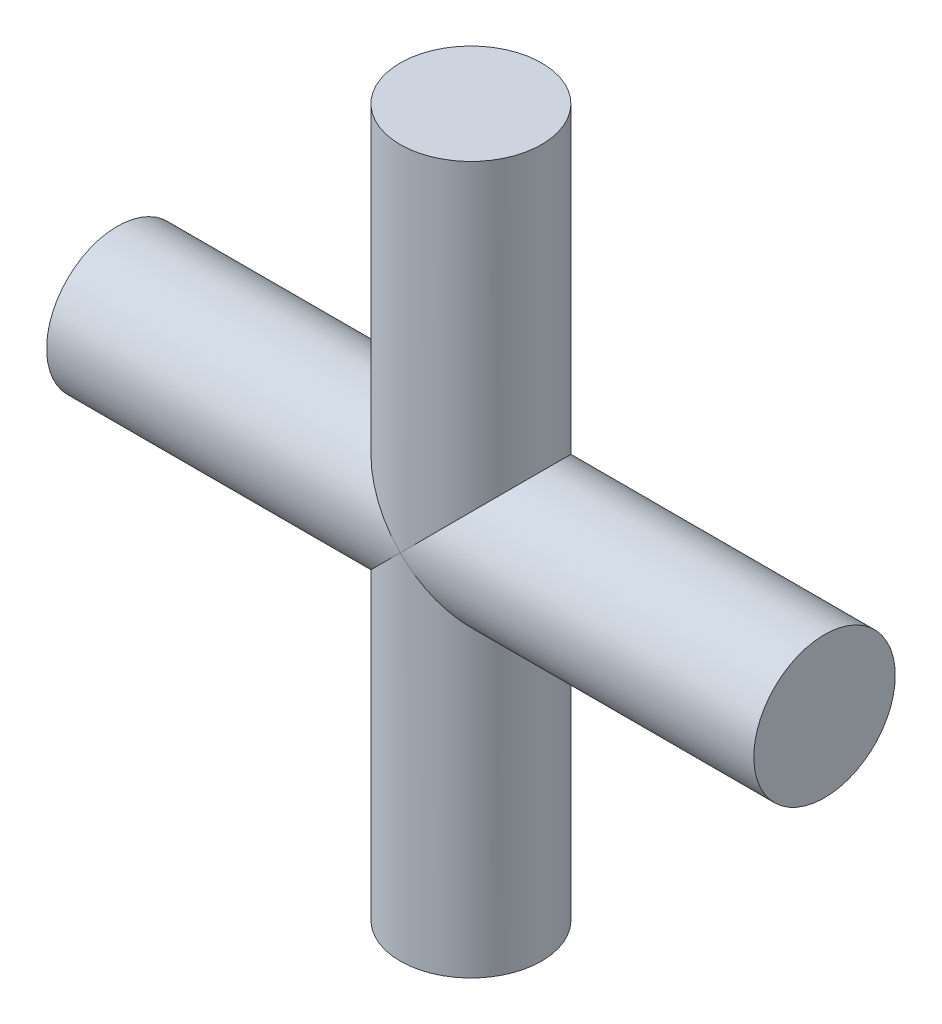
ISO-10303-21;
HEADER;
FILE_DESCRIPTION(('STEP AP214'),'2;1');
FILE_NAME('part.step','',(''),(''),'','','');
FILE_SCHEMA(('AUTOMOTIVE_DESIGN { 1 0 10303 214 1 1 1 1 }'));
ENDSEC;
DATA;
#1=APPLICATION_CONTEXT('core data for automotive mechanical design processes');
#2=APPLICATION_PROTOCOL_DEFINITION('international standard','automotive_design',2000,#1);
#3=PRODUCT_CONTEXT('',#1,'mechanical');
#4=PRODUCT('Part','Part','',(#3));
#5=PRODUCT_RELATED_PRODUCT_CATEGORY('part','',(#4));
#6=PRODUCT_DEFINITION_FORMATION('','',#4);
#7=PRODUCT_DEFINITION_CONTEXT('part definition',#1,'design');
#8=PRODUCT_DEFINITION('design','',#6,#7);
#9=PRODUCT_DEFINITION_SHAPE('','',#8);
#10=(LENGTH_UNIT() NAMED_UNIT(*) SI_UNIT(.MILLI.,.METRE.));
#11=(NAMED_UNIT(*) PLANE_ANGLE_UNIT() SI_UNIT($,.RADIAN.));
#12=(NAMED_UNIT(*) SI_UNIT($,.STERADIAN.) SOLID_ANGLE_UNIT());
#13=UNCERTAINTY_MEASURE_WITH_UNIT(LENGTH_MEASURE(1.E-05),#10,'distance_accuracy_value','');
#14=(GEOMETRIC_REPRESENTATION_CONTEXT(3) GLOBAL_UNCERTAINTY_ASSIGNED_CONTEXT((#13)) GLOBAL_UNIT_ASSIGNED_CONTEXT((#10,
#11,#12)) REPRESENTATION_CONTEXT('',''));
#15=CARTESIAN_POINT('',(0.,0.,0.));
#16=DIRECTION('',(0.,0.,1.));
#17=DIRECTION('',(1.,0.,0.));
#18=AXIS2_PLACEMENT_3D('',#15,#16,#17);
#19=CARTESIAN_POINT('',(0.,5.,0.));
#20=DIRECTION('',(0.,-1.,0.));
#21=DIRECTION('',(0.,0.,-1.));
#22=AXIS2_PLACEMENT_3D('',#19,#20,#21);
#23=CYLINDRICAL_SURFACE('',#22,1.);
#24=CARTESIAN_POINT('',(0.,5.,0.));
#25=DIRECTION('',(0.,1.,0.));
#26=DIRECTION('',(0.,0.,1.));
#27=AXIS2_PLACEMENT_3D('',#24,#25,#26);
#28=CIRCLE('',#27,1.);
#29=CARTESIAN_POINT('',(0.,5.,1.));
#30=VERTEX_POINT('',#29);
#31=EDGE_CURVE('E59',#30,#30,#28,.T.);
#32=ORIENTED_EDGE('',*,*,#31,.F.);
#33=EDGE_LOOP('',(#32));
#34=FACE_BOUND('',#33,.T.);
#35=CARTESIAN_POINT('',(0.,0.,0.));
#36=DIRECTION('',(-0.707106781186547,-0.707106781186547,0.));
#37=DIRECTION('',(0.707106781186547,-0.707106781186547,0.));
#38=AXIS2_PLACEMENT_3D('',#35,#36,#37);
#39=ELLIPSE('',#38,1.4142135623731,1.);
#40=CARTESIAN_POINT('',(0.,0.,1.));
#41=VERTEX_POINT('',#40);
#42=CARTESIAN_POINT('',(0.,0.,-1.));
#43=VERTEX_POINT('',#42);
#44=EDGE_CURVE('E43',#41,#43,#39,.T.);
#45=ORIENTED_EDGE('',*,*,#44,.F.);
#46=CARTESIAN_POINT('',(0.,0.,0.));
#47=DIRECTION('',(0.707106781186547,-0.707106781186547,0.));
#48=DIRECTION('',(-0.707106781186547,-0.707106781186547,0.));
#49=AXIS2_PLACEMENT_3D('',#46,#47,#48);
#50=ELLIPSE('',#49,1.4142135623731,1.);
#51=EDGE_CURVE('E55',#43,#41,#50,.T.);
#52=ORIENTED_EDGE('',*,*,#51,.F.);
#53=EDGE_LOOP('',(#45,#52));
#54=FACE_BOUND('',#53,.T.);
#55=ADVANCED_FACE('F35',(#34,#54),#23,.T.);
#56=CARTESIAN_POINT('',(0.,5.,0.));
#57=DIRECTION('',(0.,1.,0.));
#58=DIRECTION('',(0.,0.,1.));
#59=AXIS2_PLACEMENT_3D('',#56,#57,#58);
#60=PLANE('',#59);
#61=ORIENTED_EDGE('',*,*,#31,.T.);
#62=EDGE_LOOP('',(#61));
#63=FACE_BOUND('',#62,.T.);
#64=ADVANCED_FACE('F82',(#63),#60,.T.);
#65=CARTESIAN_POINT('',(-5.,0.,0.));
#66=DIRECTION('',(1.,0.,0.));
#67=DIRECTION('',(0.,0.,-1.));
#68=AXIS2_PLACEMENT_3D('',#65,#66,#67);
#69=PLANE('',#68);
#70=CARTESIAN_POINT('',(-5.,0.,0.));
#71=DIRECTION('',(1.,0.,0.));
#72=DIRECTION('',(0.,0.,-1.));
#73=AXIS2_PLACEMENT_3D('',#70,#71,#72);
#74=CIRCLE('',#73,1.);
#75=CARTESIAN_POINT('',(-5.,0.,-1.));
#76=VERTEX_POINT('',#75);
#77=EDGE_CURVE('E96',#76,#76,#74,.T.);
#78=ORIENTED_EDGE('',*,*,#77,.F.);
#79=EDGE_LOOP('',(#78));
#80=FACE_BOUND('',#79,.T.);
#81=ADVANCED_FACE('F79',(#80),#69,.F.);
#82=CARTESIAN_POINT('',(5.,0.,0.));
#83=DIRECTION('',(-1.,0.,0.));
#84=DIRECTION('',(0.,0.,1.));
#85=AXIS2_PLACEMENT_3D('',#82,#83,#84);
#86=CYLINDRICAL_SURFACE('',#85,1.);
#87=ORIENTED_EDGE('',*,*,#77,.T.);
#88=EDGE_LOOP('',(#87));
#89=FACE_BOUND('',#88,.T.);
#90=CARTESIAN_POINT('',(0.,0.,0.));
#91=DIRECTION('',(0.707106781186547,-0.707106781186547,0.));
#92=DIRECTION('',(-0.707106781186547,-0.707106781186547,0.));
#93=AXIS2_PLACEMENT_3D('',#90,#91,#92);
#94=ELLIPSE('',#93,1.4142135623731,1.);
#95=EDGE_CURVE('E49',#43,#41,#94,.F.);
#96=ORIENTED_EDGE('',*,*,#95,.T.);
#97=ORIENTED_EDGE('',*,*,#44,.T.);
#98=EDGE_LOOP('',(#96,#97));
#99=FACE_BOUND('',#98,.T.);
#100=ADVANCED_FACE('F61',(#89,#99),#86,.T.);
#101=CARTESIAN_POINT('',(0.,-5.,0.));
#102=DIRECTION('',(0.,1.,0.));
#103=DIRECTION('',(0.,0.,1.));
#104=AXIS2_PLACEMENT_3D('',#101,#102,#103);
#105=PLANE('',#104);
#106=CARTESIAN_POINT('',(0.,-5.,0.));
#107=DIRECTION('',(0.,1.,0.));
#108=DIRECTION('',(0.,0.,1.));
#109=AXIS2_PLACEMENT_3D('',#106,#107,#108);
#110=CIRCLE('',#109,1.);
#111=CARTESIAN_POINT('',(0.,-5.,1.));
#112=VERTEX_POINT('',#111);
#113=EDGE_CURVE('E90',#112,#112,#110,.T.);
#114=ORIENTED_EDGE('',*,*,#113,.F.);
#115=EDGE_LOOP('',(#114));
#116=FACE_BOUND('',#115,.T.);
#117=ADVANCED_FACE('F73',(#116),#105,.F.);
#118=ORIENTED_EDGE('',*,*,#113,.T.);
#119=EDGE_LOOP('',(#118));
#120=FACE_BOUND('',#119,.T.);
#121=CARTESIAN_POINT('',(0.,0.,0.));
#122=DIRECTION('',(-0.707106781186547,-0.707106781186547,0.));
#123=DIRECTION('',(0.707106781186547,-0.707106781186547,0.));
#124=AXIS2_PLACEMENT_3D('',#121,#122,#123);
#125=ELLIPSE('',#124,1.4142135623731,1.);
#126=EDGE_CURVE('E11',#41,#43,#125,.F.);
#127=ORIENTED_EDGE('',*,*,#126,.F.);
#128=ORIENTED_EDGE('',*,*,#95,.F.);
#129=EDGE_LOOP('',(#127,#128));
#130=FACE_BOUND('',#129,.T.);
#131=ADVANCED_FACE('F37',(#120,#130),#23,.T.);
#132=CARTESIAN_POINT('',(5.,0.,0.));
#133=DIRECTION('',(1.,0.,0.));
#134=DIRECTION('',(0.,0.,-1.));
#135=AXIS2_PLACEMENT_3D('',#132,#133,#134);
#136=CIRCLE('',#135,1.);
#137=CARTESIAN_POINT('',(5.,0.,-1.));
#138=VERTEX_POINT('',#137);
#139=EDGE_CURVE('E93',#138,#138,#136,.T.);
#140=ORIENTED_EDGE('',*,*,#139,.F.);
#141=EDGE_LOOP('',(#140));
#142=FACE_BOUND('',#141,.T.);
#143=ORIENTED_EDGE('',*,*,#51,.T.);
#144=ORIENTED_EDGE('',*,*,#126,.T.);
#145=EDGE_LOOP('',(#143,#144));
#146=FACE_BOUND('',#145,.T.);
#147=ADVANCED_FACE('F62',(#142,#146),#86,.T.);
#148=CARTESIAN_POINT('',(5.,0.,0.));
#149=DIRECTION('',(1.,0.,0.));
#150=DIRECTION('',(0.,0.,-1.));
#151=AXIS2_PLACEMENT_3D('',#148,#149,#150);
#152=PLANE('',#151);
#153=ORIENTED_EDGE('',*,*,#139,.T.);
#154=EDGE_LOOP('',(#153));
#155=FACE_BOUND('',#154,.T.);
#156=ADVANCED_FACE('F64',(#155),#152,.T.);
#157=CLOSED_SHELL('',(#55,#64,#81,#100,#117,#131,#147,#156));
#158=MANIFOLD_SOLID_BREP('B2',#157);
#159=ADVANCED_BREP_SHAPE_REPRESENTATION('',(#18,#158),#14);
#160=SHAPE_DEFINITION_REPRESENTATION(#9,#159);
ENDSEC;
END-ISO-10303-21;
